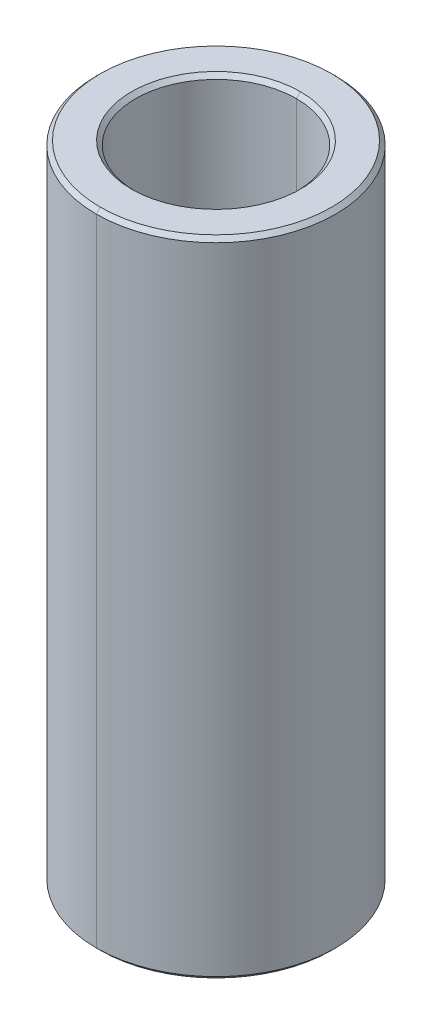
ISO-10303-21;
HEADER;
FILE_DESCRIPTION(('STEP AP214'),'2;1');
FILE_NAME('part.step','',(''),(''),'','','');
FILE_SCHEMA(('AUTOMOTIVE_DESIGN { 1 0 10303 214 1 1 1 1 }'));
ENDSEC;
DATA;
#1=APPLICATION_CONTEXT('core data for automotive mechanical design processes');
#2=APPLICATION_PROTOCOL_DEFINITION('international standard','automotive_design',2000,#1);
#3=PRODUCT_CONTEXT('',#1,'mechanical');
#4=PRODUCT('Part','Part','',(#3));
#5=PRODUCT_RELATED_PRODUCT_CATEGORY('part','',(#4));
#6=PRODUCT_DEFINITION_FORMATION('','',#4);
#7=PRODUCT_DEFINITION_CONTEXT('part definition',#1,'design');
#8=PRODUCT_DEFINITION('design','',#6,#7);
#9=PRODUCT_DEFINITION_SHAPE('','',#8);
#10=(LENGTH_UNIT() NAMED_UNIT(*) SI_UNIT(.MILLI.,.METRE.));
#11=(NAMED_UNIT(*) PLANE_ANGLE_UNIT() SI_UNIT($,.RADIAN.));
#12=(NAMED_UNIT(*) SI_UNIT($,.STERADIAN.) SOLID_ANGLE_UNIT());
#13=UNCERTAINTY_MEASURE_WITH_UNIT(LENGTH_MEASURE(1.E-05),#10,'distance_accuracy_value','');
#14=(GEOMETRIC_REPRESENTATION_CONTEXT(3) GLOBAL_UNCERTAINTY_ASSIGNED_CONTEXT((#13)) GLOBAL_UNIT_ASSIGNED_CONTEXT((#10,
#11,#12)) REPRESENTATION_CONTEXT('',''));
#15=CARTESIAN_POINT('',(0.,0.,0.));
#16=DIRECTION('',(0.,0.,1.));
#17=DIRECTION('',(1.,0.,0.));
#18=AXIS2_PLACEMENT_3D('',#15,#16,#17);
#19=CARTESIAN_POINT('',(0.,7.9,0.));
#20=DIRECTION('',(0.,1.,0.));
#21=DIRECTION('',(0.,0.,1.));
#22=AXIS2_PLACEMENT_3D('',#19,#20,#21);
#23=CONICAL_SURFACE('',#22,2.,0.78539816339744);
#24=DIRECTION('',(0.,0.707106781186554,-0.707106781186542));
#25=VECTOR('',#24,1.);
#26=CARTESIAN_POINT('',(0.,7.9,-2.));
#27=LINE('',#26,#25);
#28=CARTESIAN_POINT('',(0.,7.9,-2.));
#29=VERTEX_POINT('',#28);
#30=CARTESIAN_POINT('',(0.,8.,-2.1));
#31=VERTEX_POINT('',#30);
#32=EDGE_CURVE('E173',#29,#31,#27,.T.);
#33=ORIENTED_EDGE('',*,*,#32,.F.);
#34=CARTESIAN_POINT('',(0.,7.9,0.));
#35=DIRECTION('',(0.,1.,0.));
#36=DIRECTION('',(0.,0.,1.));
#37=AXIS2_PLACEMENT_3D('',#34,#35,#36);
#38=CIRCLE('',#37,2.);
#39=CARTESIAN_POINT('',(0.,7.9,2.));
#40=VERTEX_POINT('',#39);
#41=EDGE_CURVE('E25',#40,#29,#38,.T.);
#42=ORIENTED_EDGE('',*,*,#41,.F.);
#43=DIRECTION('',(0.,0.707106781186554,0.707106781186542));
#44=VECTOR('',#43,1.);
#45=CARTESIAN_POINT('',(0.,7.9,2.));
#46=LINE('',#45,#44);
#47=CARTESIAN_POINT('',(0.,8.,2.1));
#48=VERTEX_POINT('',#47);
#49=EDGE_CURVE('E18',#40,#48,#46,.T.);
#50=ORIENTED_EDGE('',*,*,#49,.T.);
#51=CARTESIAN_POINT('',(0.,8.,0.));
#52=DIRECTION('',(0.,-1.,0.));
#53=DIRECTION('',(0.,0.,1.));
#54=AXIS2_PLACEMENT_3D('',#51,#52,#53);
#55=CIRCLE('',#54,2.1);
#56=EDGE_CURVE('E169',#31,#48,#55,.T.);
#57=ORIENTED_EDGE('',*,*,#56,.F.);
#58=EDGE_LOOP('',(#33,#42,#50,#57));
#59=FACE_BOUND('',#58,.T.);
#60=ADVANCED_FACE('F14',(#59),#23,.F.);
#61=CARTESIAN_POINT('',(0.,-8.,0.));
#62=DIRECTION('',(0.,-1.,0.));
#63=DIRECTION('',(0.,0.,-1.));
#64=AXIS2_PLACEMENT_3D('',#61,#62,#63);
#65=CONICAL_SURFACE('',#64,2.1,0.78539816339744);
#66=DIRECTION('',(0.,-0.707106781186554,0.707106781186542));
#67=VECTOR('',#66,1.);
#68=CARTESIAN_POINT('',(0.,-8.,2.1));
#69=LINE('',#68,#67);
#70=CARTESIAN_POINT('',(0.,-7.9,2.));
#71=VERTEX_POINT('',#70);
#72=CARTESIAN_POINT('',(0.,-8.,2.1));
#73=VERTEX_POINT('',#72);
#74=EDGE_CURVE('E127',#71,#73,#69,.T.);
#75=ORIENTED_EDGE('',*,*,#74,.F.);
#76=CARTESIAN_POINT('',(0.,-7.9,0.));
#77=DIRECTION('',(0.,-1.,0.));
#78=DIRECTION('',(0.,0.,1.));
#79=AXIS2_PLACEMENT_3D('',#76,#77,#78);
#80=CIRCLE('',#79,2.);
#81=CARTESIAN_POINT('',(0.,-7.9,-2.));
#82=VERTEX_POINT('',#81);
#83=EDGE_CURVE('E9',#82,#71,#80,.T.);
#84=ORIENTED_EDGE('',*,*,#83,.F.);
#85=DIRECTION('',(0.,-0.707106781186554,-0.707106781186542));
#86=VECTOR('',#85,1.);
#87=CARTESIAN_POINT('',(0.,-8.,-2.1));
#88=LINE('',#87,#86);
#89=CARTESIAN_POINT('',(0.,-8.,-2.1));
#90=VERTEX_POINT('',#89);
#91=EDGE_CURVE('E117',#82,#90,#88,.T.);
#92=ORIENTED_EDGE('',*,*,#91,.T.);
#93=CARTESIAN_POINT('',(0.,-8.,0.));
#94=DIRECTION('',(0.,1.,0.));
#95=DIRECTION('',(0.,0.,1.));
#96=AXIS2_PLACEMENT_3D('',#93,#94,#95);
#97=CIRCLE('',#96,2.1);
#98=EDGE_CURVE('E102',#73,#90,#97,.T.);
#99=ORIENTED_EDGE('',*,*,#98,.F.);
#100=EDGE_LOOP('',(#75,#84,#92,#99));
#101=FACE_BOUND('',#100,.T.);
#102=ADVANCED_FACE('F118',(#101),#65,.F.);
#103=CARTESIAN_POINT('',(0.,8.,0.));
#104=DIRECTION('',(0.,-1.,0.));
#105=DIRECTION('',(0.,0.,-1.));
#106=AXIS2_PLACEMENT_3D('',#103,#104,#105);
#107=CONICAL_SURFACE('',#106,2.875,0.78539816339744);
#108=DIRECTION('',(0.,-0.707106781186554,0.707106781186542));
#109=VECTOR('',#108,1.);
#110=CARTESIAN_POINT('',(0.,8.,2.875));
#111=LINE('',#110,#109);
#112=CARTESIAN_POINT('',(0.,8.,2.875));
#113=VERTEX_POINT('',#112);
#114=CARTESIAN_POINT('',(0.,7.9,2.975));
#115=VERTEX_POINT('',#114);
#116=EDGE_CURVE('E194',#113,#115,#111,.T.);
#117=ORIENTED_EDGE('',*,*,#116,.F.);
#118=CARTESIAN_POINT('',(0.,8.,0.));
#119=DIRECTION('',(0.,1.,0.));
#120=DIRECTION('',(0.,0.,1.));
#121=AXIS2_PLACEMENT_3D('',#118,#119,#120);
#122=CIRCLE('',#121,2.875);
#123=CARTESIAN_POINT('',(0.,8.,-2.875));
#124=VERTEX_POINT('',#123);
#125=EDGE_CURVE('E94',#124,#113,#122,.T.);
#126=ORIENTED_EDGE('',*,*,#125,.F.);
#127=DIRECTION('',(0.,-0.707106781186554,-0.707106781186542));
#128=VECTOR('',#127,1.);
#129=CARTESIAN_POINT('',(0.,8.,-2.875));
#130=LINE('',#129,#128);
#131=CARTESIAN_POINT('',(0.,7.9,-2.975));
#132=VERTEX_POINT('',#131);
#133=EDGE_CURVE('E186',#124,#132,#130,.T.);
#134=ORIENTED_EDGE('',*,*,#133,.T.);
#135=CARTESIAN_POINT('',(0.,7.9,0.));
#136=DIRECTION('',(0.,-1.,0.));
#137=DIRECTION('',(0.,0.,1.));
#138=AXIS2_PLACEMENT_3D('',#135,#136,#137);
#139=CIRCLE('',#138,2.975);
#140=EDGE_CURVE('E112',#115,#132,#139,.T.);
#141=ORIENTED_EDGE('',*,*,#140,.F.);
#142=EDGE_LOOP('',(#117,#126,#134,#141));
#143=FACE_BOUND('',#142,.T.);
#144=ADVANCED_FACE('F356',(#143),#107,.T.);
#145=CARTESIAN_POINT('',(0.,-7.9,0.));
#146=DIRECTION('',(0.,1.,0.));
#147=DIRECTION('',(0.,0.,1.));
#148=AXIS2_PLACEMENT_3D('',#145,#146,#147);
#149=CONICAL_SURFACE('',#148,2.975,0.78539816339744);
#150=DIRECTION('',(0.,0.707106781186554,-0.707106781186542));
#151=VECTOR('',#150,1.);
#152=CARTESIAN_POINT('',(0.,-7.9,-2.975));
#153=LINE('',#152,#151);
#154=CARTESIAN_POINT('',(0.,-8.,-2.875));
#155=VERTEX_POINT('',#154);
#156=CARTESIAN_POINT('',(0.,-7.9,-2.975));
#157=VERTEX_POINT('',#156);
#158=EDGE_CURVE('E162',#155,#157,#153,.T.);
#159=ORIENTED_EDGE('',*,*,#158,.F.);
#160=CARTESIAN_POINT('',(0.,-8.,0.));
#161=DIRECTION('',(0.,-1.,0.));
#162=DIRECTION('',(0.,0.,1.));
#163=AXIS2_PLACEMENT_3D('',#160,#161,#162);
#164=CIRCLE('',#163,2.875);
#165=CARTESIAN_POINT('',(0.,-8.,2.875));
#166=VERTEX_POINT('',#165);
#167=EDGE_CURVE('E113',#166,#155,#164,.T.);
#168=ORIENTED_EDGE('',*,*,#167,.F.);
#169=DIRECTION('',(0.,0.707106781186554,0.707106781186542));
#170=VECTOR('',#169,1.);
#171=CARTESIAN_POINT('',(0.,-7.9,2.975));
#172=LINE('',#171,#170);
#173=CARTESIAN_POINT('',(0.,-7.9,2.975));
#174=VERTEX_POINT('',#173);
#175=EDGE_CURVE('E142',#166,#174,#172,.T.);
#176=ORIENTED_EDGE('',*,*,#175,.T.);
#177=CARTESIAN_POINT('',(0.,-7.9,0.));
#178=DIRECTION('',(0.,1.,0.));
#179=DIRECTION('',(0.,0.,1.));
#180=AXIS2_PLACEMENT_3D('',#177,#178,#179);
#181=CIRCLE('',#180,2.975);
#182=EDGE_CURVE('E40',#157,#174,#181,.T.);
#183=ORIENTED_EDGE('',*,*,#182,.F.);
#184=EDGE_LOOP('',(#159,#168,#176,#183));
#185=FACE_BOUND('',#184,.T.);
#186=ADVANCED_FACE('F16',(#185),#149,.T.);
#187=CARTESIAN_POINT('',(0.,8.,0.));
#188=DIRECTION('',(0.,-1.,0.));
#189=DIRECTION('',(0.,0.,-1.));
#190=AXIS2_PLACEMENT_3D('',#187,#188,#189);
#191=CYLINDRICAL_SURFACE('',#190,2.);
#192=DIRECTION('',(0.,-1.,0.));
#193=VECTOR('',#192,1.);
#194=CARTESIAN_POINT('',(0.,8.,2.));
#195=LINE('',#194,#193);
#196=EDGE_CURVE('E140',#40,#71,#195,.T.);
#197=ORIENTED_EDGE('',*,*,#196,.F.);
#198=ORIENTED_EDGE('',*,*,#41,.T.);
#199=DIRECTION('',(0.,-1.,0.));
#200=VECTOR('',#199,1.);
#201=CARTESIAN_POINT('',(0.,8.,-2.));
#202=LINE('',#201,#200);
#203=EDGE_CURVE('E138',#29,#82,#202,.T.);
#204=ORIENTED_EDGE('',*,*,#203,.T.);
#205=ORIENTED_EDGE('',*,*,#83,.T.);
#206=EDGE_LOOP('',(#197,#198,#204,#205));
#207=FACE_BOUND('',#206,.T.);
#208=ADVANCED_FACE('F300',(#207),#191,.F.);
#209=CARTESIAN_POINT('',(0.,8.,0.));
#210=DIRECTION('',(0.,-1.,0.));
#211=DIRECTION('',(0.,0.,-1.));
#212=AXIS2_PLACEMENT_3D('',#209,#210,#211);
#213=CYLINDRICAL_SURFACE('',#212,2.975);
#214=DIRECTION('',(0.,-1.,0.));
#215=VECTOR('',#214,1.);
#216=CARTESIAN_POINT('',(0.,8.,2.975));
#217=LINE('',#216,#215);
#218=EDGE_CURVE('E148',#115,#174,#217,.T.);
#219=ORIENTED_EDGE('',*,*,#218,.F.);
#220=ORIENTED_EDGE('',*,*,#140,.T.);
#221=DIRECTION('',(0.,-1.,0.));
#222=VECTOR('',#221,1.);
#223=CARTESIAN_POINT('',(0.,8.,-2.975));
#224=LINE('',#223,#222);
#225=EDGE_CURVE('E170',#132,#157,#224,.T.);
#226=ORIENTED_EDGE('',*,*,#225,.T.);
#227=ORIENTED_EDGE('',*,*,#182,.T.);
#228=EDGE_LOOP('',(#219,#220,#226,#227));
#229=FACE_BOUND('',#228,.T.);
#230=ADVANCED_FACE('F204',(#229),#213,.T.);
#231=CARTESIAN_POINT('',(0.,-8.,0.));
#232=DIRECTION('',(0.,1.,0.));
#233=DIRECTION('',(1.,0.,0.));
#234=AXIS2_PLACEMENT_3D('',#231,#232,#233);
#235=PLANE('',#234);
#236=CARTESIAN_POINT('',(0.,-8.,0.));
#237=DIRECTION('',(0.,1.,0.));
#238=DIRECTION('',(0.,0.,1.));
#239=AXIS2_PLACEMENT_3D('',#236,#237,#238);
#240=CIRCLE('',#239,2.1);
#241=EDGE_CURVE('E107',#90,#73,#240,.T.);
#242=ORIENTED_EDGE('',*,*,#241,.T.);
#243=ORIENTED_EDGE('',*,*,#98,.T.);
#244=EDGE_LOOP('',(#242,#243));
#245=FACE_BOUND('',#244,.T.);
#246=ORIENTED_EDGE('',*,*,#167,.T.);
#247=CARTESIAN_POINT('',(0.,-8.,0.));
#248=DIRECTION('',(0.,-1.,0.));
#249=DIRECTION('',(0.,0.,1.));
#250=AXIS2_PLACEMENT_3D('',#247,#248,#249);
#251=CIRCLE('',#250,2.875);
#252=EDGE_CURVE('E182',#155,#166,#251,.T.);
#253=ORIENTED_EDGE('',*,*,#252,.T.);
#254=EDGE_LOOP('',(#246,#253));
#255=FACE_BOUND('',#254,.T.);
#256=ADVANCED_FACE('F104',(#245,#255),#235,.F.);
#257=CARTESIAN_POINT('',(0.,8.,0.));
#258=DIRECTION('',(0.,1.,0.));
#259=DIRECTION('',(1.,0.,0.));
#260=AXIS2_PLACEMENT_3D('',#257,#258,#259);
#261=PLANE('',#260);
#262=CARTESIAN_POINT('',(0.,8.,0.));
#263=DIRECTION('',(0.,-1.,0.));
#264=DIRECTION('',(0.,0.,1.));
#265=AXIS2_PLACEMENT_3D('',#262,#263,#264);
#266=CIRCLE('',#265,2.1);
#267=EDGE_CURVE('E177',#48,#31,#266,.T.);
#268=ORIENTED_EDGE('',*,*,#267,.T.);
#269=ORIENTED_EDGE('',*,*,#56,.T.);
#270=EDGE_LOOP('',(#268,#269));
#271=FACE_BOUND('',#270,.T.);
#272=ORIENTED_EDGE('',*,*,#125,.T.);
#273=CARTESIAN_POINT('',(0.,8.,0.));
#274=DIRECTION('',(0.,1.,0.));
#275=DIRECTION('',(0.,0.,1.));
#276=AXIS2_PLACEMENT_3D('',#273,#274,#275);
#277=CIRCLE('',#276,2.875);
#278=EDGE_CURVE('E124',#113,#124,#277,.T.);
#279=ORIENTED_EDGE('',*,*,#278,.T.);
#280=EDGE_LOOP('',(#272,#279));
#281=FACE_BOUND('',#280,.T.);
#282=ADVANCED_FACE('F327',(#271,#281),#261,.T.);
#283=CARTESIAN_POINT('',(0.,8.,0.));
#284=DIRECTION('',(0.,-1.,0.));
#285=DIRECTION('',(0.,0.,-1.));
#286=AXIS2_PLACEMENT_3D('',#283,#284,#285);
#287=CYLINDRICAL_SURFACE('',#286,2.975);
#288=CARTESIAN_POINT('',(0.,7.9,0.));
#289=DIRECTION('',(0.,-1.,0.));
#290=DIRECTION('',(0.,0.,1.));
#291=AXIS2_PLACEMENT_3D('',#288,#289,#290);
#292=CIRCLE('',#291,2.975);
#293=EDGE_CURVE('E190',#132,#115,#292,.T.);
#294=ORIENTED_EDGE('',*,*,#293,.T.);
#295=ORIENTED_EDGE('',*,*,#218,.T.);
#296=CARTESIAN_POINT('',(0.,-7.9,0.));
#297=DIRECTION('',(0.,1.,0.));
#298=DIRECTION('',(0.,0.,1.));
#299=AXIS2_PLACEMENT_3D('',#296,#297,#298);
#300=CIRCLE('',#299,2.975);
#301=EDGE_CURVE('E151',#174,#157,#300,.T.);
#302=ORIENTED_EDGE('',*,*,#301,.T.);
#303=ORIENTED_EDGE('',*,*,#225,.F.);
#304=EDGE_LOOP('',(#294,#295,#302,#303));
#305=FACE_BOUND('',#304,.T.);
#306=ADVANCED_FACE('F208',(#305),#287,.T.);
#307=CARTESIAN_POINT('',(0.,8.,0.));
#308=DIRECTION('',(0.,-1.,0.));
#309=DIRECTION('',(0.,0.,-1.));
#310=AXIS2_PLACEMENT_3D('',#307,#308,#309);
#311=CYLINDRICAL_SURFACE('',#310,2.);
#312=CARTESIAN_POINT('',(0.,7.9,0.));
#313=DIRECTION('',(0.,1.,0.));
#314=DIRECTION('',(0.,0.,1.));
#315=AXIS2_PLACEMENT_3D('',#312,#313,#314);
#316=CIRCLE('',#315,2.);
#317=EDGE_CURVE('E166',#29,#40,#316,.T.);
#318=ORIENTED_EDGE('',*,*,#317,.T.);
#319=ORIENTED_EDGE('',*,*,#196,.T.);
#320=CARTESIAN_POINT('',(0.,-7.9,0.));
#321=DIRECTION('',(0.,-1.,0.));
#322=DIRECTION('',(0.,0.,1.));
#323=AXIS2_PLACEMENT_3D('',#320,#321,#322);
#324=CIRCLE('',#323,2.);
#325=EDGE_CURVE('E135',#71,#82,#324,.T.);
#326=ORIENTED_EDGE('',*,*,#325,.T.);
#327=ORIENTED_EDGE('',*,*,#203,.F.);
#328=EDGE_LOOP('',(#318,#319,#326,#327));
#329=FACE_BOUND('',#328,.T.);
#330=ADVANCED_FACE('F309',(#329),#311,.F.);
#331=CARTESIAN_POINT('',(0.,-7.9,0.));
#332=DIRECTION('',(0.,1.,0.));
#333=DIRECTION('',(0.,0.,1.));
#334=AXIS2_PLACEMENT_3D('',#331,#332,#333);
#335=CONICAL_SURFACE('',#334,2.975,0.78539816339744);
#336=ORIENTED_EDGE('',*,*,#252,.F.);
#337=ORIENTED_EDGE('',*,*,#158,.T.);
#338=ORIENTED_EDGE('',*,*,#301,.F.);
#339=ORIENTED_EDGE('',*,*,#175,.F.);
#340=EDGE_LOOP('',(#336,#337,#338,#339));
#341=FACE_BOUND('',#340,.T.);
#342=ADVANCED_FACE('F212',(#341),#335,.T.);
#343=CARTESIAN_POINT('',(0.,8.,0.));
#344=DIRECTION('',(0.,-1.,0.));
#345=DIRECTION('',(0.,0.,-1.));
#346=AXIS2_PLACEMENT_3D('',#343,#344,#345);
#347=CONICAL_SURFACE('',#346,2.875,0.78539816339744);
#348=ORIENTED_EDGE('',*,*,#278,.F.);
#349=ORIENTED_EDGE('',*,*,#116,.T.);
#350=ORIENTED_EDGE('',*,*,#293,.F.);
#351=ORIENTED_EDGE('',*,*,#133,.F.);
#352=EDGE_LOOP('',(#348,#349,#350,#351));
#353=FACE_BOUND('',#352,.T.);
#354=ADVANCED_FACE('F365',(#353),#347,.T.);
#355=CARTESIAN_POINT('',(0.,-8.,0.));
#356=DIRECTION('',(0.,-1.,0.));
#357=DIRECTION('',(0.,0.,-1.));
#358=AXIS2_PLACEMENT_3D('',#355,#356,#357);
#359=CONICAL_SURFACE('',#358,2.1,0.78539816339744);
#360=ORIENTED_EDGE('',*,*,#325,.F.);
#361=ORIENTED_EDGE('',*,*,#74,.T.);
#362=ORIENTED_EDGE('',*,*,#241,.F.);
#363=ORIENTED_EDGE('',*,*,#91,.F.);
#364=EDGE_LOOP('',(#360,#361,#362,#363));
#365=FACE_BOUND('',#364,.T.);
#366=ADVANCED_FACE('F126',(#365),#359,.F.);
#367=CARTESIAN_POINT('',(0.,7.9,0.));
#368=DIRECTION('',(0.,1.,0.));
#369=DIRECTION('',(0.,0.,1.));
#370=AXIS2_PLACEMENT_3D('',#367,#368,#369);
#371=CONICAL_SURFACE('',#370,2.,0.78539816339744);
#372=ORIENTED_EDGE('',*,*,#317,.F.);
#373=ORIENTED_EDGE('',*,*,#32,.T.);
#374=ORIENTED_EDGE('',*,*,#267,.F.);
#375=ORIENTED_EDGE('',*,*,#49,.F.);
#376=EDGE_LOOP('',(#372,#373,#374,#375));
#377=FACE_BOUND('',#376,.T.);
#378=ADVANCED_FACE('F339',(#377),#371,.F.);
#379=CLOSED_SHELL('',(#60,#102,#144,#186,#208,#230,#256,#282,#306,#330,#342,#354,#366,#378));
#380=MANIFOLD_SOLID_BREP('B1',#379);
#381=ADVANCED_BREP_SHAPE_REPRESENTATION('',(#18,#380),#14);
#382=SHAPE_DEFINITION_REPRESENTATION(#9,#381);
ENDSEC;
END-ISO-10303-21;
